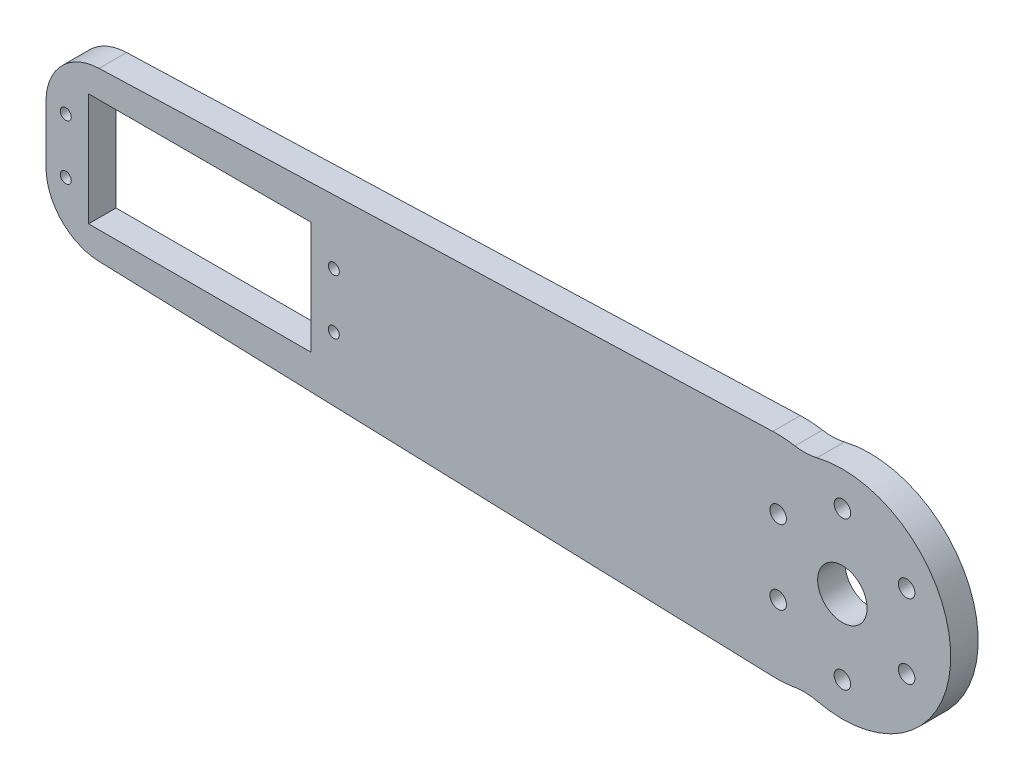
ISO-10303-21;
HEADER;
FILE_DESCRIPTION(('STEP AP214'),'2;1');
FILE_NAME('part.step','',(''),(''),'','','');
FILE_SCHEMA(('AUTOMOTIVE_DESIGN { 1 0 10303 214 1 1 1 1 }'));
ENDSEC;
DATA;
#1=APPLICATION_CONTEXT('core data for automotive mechanical design processes');
#2=APPLICATION_PROTOCOL_DEFINITION('international standard','automotive_design',2000,#1);
#3=PRODUCT_CONTEXT('',#1,'mechanical');
#4=PRODUCT('Part','Part','',(#3));
#5=PRODUCT_RELATED_PRODUCT_CATEGORY('part','',(#4));
#6=PRODUCT_DEFINITION_FORMATION('','',#4);
#7=PRODUCT_DEFINITION_CONTEXT('part definition',#1,'design');
#8=PRODUCT_DEFINITION('design','',#6,#7);
#9=PRODUCT_DEFINITION_SHAPE('','',#8);
#10=(LENGTH_UNIT() NAMED_UNIT(*) SI_UNIT(.MILLI.,.METRE.));
#11=(NAMED_UNIT(*) PLANE_ANGLE_UNIT() SI_UNIT($,.RADIAN.));
#12=(NAMED_UNIT(*) SI_UNIT($,.STERADIAN.) SOLID_ANGLE_UNIT());
#13=UNCERTAINTY_MEASURE_WITH_UNIT(LENGTH_MEASURE(1.E-05),#10,'distance_accuracy_value','');
#14=(GEOMETRIC_REPRESENTATION_CONTEXT(3) GLOBAL_UNCERTAINTY_ASSIGNED_CONTEXT((#13)) GLOBAL_UNIT_ASSIGNED_CONTEXT((#10,
#11,#12)) REPRESENTATION_CONTEXT('',''));
#15=CARTESIAN_POINT('',(0.,0.,0.));
#16=DIRECTION('',(0.,0.,1.));
#17=DIRECTION('',(1.,0.,0.));
#18=AXIS2_PLACEMENT_3D('',#15,#16,#17);
#19=CARTESIAN_POINT('',(0.,0.,5.));
#20=DIRECTION('',(0.,0.,1.));
#21=DIRECTION('',(1.,0.,0.));
#22=AXIS2_PLACEMENT_3D('',#19,#20,#21);
#23=PLANE('',#22);
#24=CARTESIAN_POINT('',(78.6913429510898,6.75000000000014,5.));
#25=DIRECTION('',(0.,0.,1.));
#26=DIRECTION('',(0.50000000000001,-0.866025403784433,0.));
#27=AXIS2_PLACEMENT_3D('',#24,#25,#26);
#28=CIRCLE('',#27,1.5);
#29=CARTESIAN_POINT('',(79.4413429510898,5.45096189432349,5.));
#30=VERTEX_POINT('',#29);
#31=EDGE_CURVE('E661',#30,#30,#28,.T.);
#32=ORIENTED_EDGE('',*,*,#31,.F.);
#33=EDGE_LOOP('',(#32));
#34=FACE_BOUND('',#33,.T.);
#35=CARTESIAN_POINT('',(78.6913429510899,-6.7499999999999,5.));
#36=DIRECTION('',(0.,0.,1.));
#37=DIRECTION('',(-0.499999999999992,-0.866025403784443,0.));
#38=AXIS2_PLACEMENT_3D('',#35,#36,#37);
#39=CIRCLE('',#38,1.5);
#40=CARTESIAN_POINT('',(77.94134295109,-8.04903810567656,5.));
#41=VERTEX_POINT('',#40);
#42=EDGE_CURVE('E663',#41,#41,#39,.T.);
#43=ORIENTED_EDGE('',*,*,#42,.F.);
#44=EDGE_LOOP('',(#43));
#45=FACE_BOUND('',#44,.T.);
#46=CARTESIAN_POINT('',(67.,-13.5,5.));
#47=DIRECTION('',(0.,0.,1.));
#48=DIRECTION('',(-1.,0.,0.));
#49=AXIS2_PLACEMENT_3D('',#46,#47,#48);
#50=CIRCLE('',#49,1.5);
#51=CARTESIAN_POINT('',(65.5,-13.5,5.));
#52=VERTEX_POINT('',#51);
#53=EDGE_CURVE('E666',#52,#52,#50,.T.);
#54=ORIENTED_EDGE('',*,*,#53,.F.);
#55=EDGE_LOOP('',(#54));
#56=FACE_BOUND('',#55,.T.);
#57=CARTESIAN_POINT('',(55.3086570489101,-6.75000000000005,5.));
#58=DIRECTION('',(0.,0.,1.));
#59=DIRECTION('',(-0.500000000000004,0.866025403784436,0.));
#60=AXIS2_PLACEMENT_3D('',#57,#58,#59);
#61=CIRCLE('',#60,1.5);
#62=CARTESIAN_POINT('',(54.5586570489101,-5.4509618943234,5.));
#63=VERTEX_POINT('',#62);
#64=EDGE_CURVE('E672',#63,#63,#61,.T.);
#65=ORIENTED_EDGE('',*,*,#64,.F.);
#66=EDGE_LOOP('',(#65));
#67=FACE_BOUND('',#66,.T.);
#68=CARTESIAN_POINT('',(55.30865704891,6.74999999999998,5.));
#69=DIRECTION('',(0.,0.,1.));
#70=DIRECTION('',(0.499999999999998,0.86602540378444,0.));
#71=AXIS2_PLACEMENT_3D('',#68,#69,#70);
#72=CIRCLE('',#71,1.5);
#73=CARTESIAN_POINT('',(56.05865704891,8.04903810567663,5.));
#74=VERTEX_POINT('',#73);
#75=EDGE_CURVE('E303',#74,#74,#72,.T.);
#76=ORIENTED_EDGE('',*,*,#75,.F.);
#77=EDGE_LOOP('',(#76));
#78=FACE_BOUND('',#77,.T.);
#79=CARTESIAN_POINT('',(67.,0.,5.));
#80=DIRECTION('',(0.,0.,1.));
#81=DIRECTION('',(1.,0.,0.));
#82=AXIS2_PLACEMENT_3D('',#79,#80,#81);
#83=CIRCLE('',#82,4.5);
#84=CARTESIAN_POINT('',(71.5,0.,5.));
#85=VERTEX_POINT('',#84);
#86=EDGE_CURVE('E297',#85,#85,#83,.T.);
#87=ORIENTED_EDGE('',*,*,#86,.F.);
#88=EDGE_LOOP('',(#87));
#89=FACE_BOUND('',#88,.T.);
#90=CARTESIAN_POINT('',(67.,13.5,5.));
#91=DIRECTION('',(0.,0.,1.));
#92=DIRECTION('',(1.,0.,0.));
#93=AXIS2_PLACEMENT_3D('',#90,#91,#92);
#94=CIRCLE('',#93,1.5);
#95=CARTESIAN_POINT('',(68.5,13.5,5.));
#96=VERTEX_POINT('',#95);
#97=EDGE_CURVE('E292',#96,#96,#94,.T.);
#98=ORIENTED_EDGE('',*,*,#97,.F.);
#99=EDGE_LOOP('',(#98));
#100=FACE_BOUND('',#99,.T.);
#101=CARTESIAN_POINT('',(-74.4,-5.00000000000002,5.));
#102=DIRECTION('',(0.,0.,1.));
#103=DIRECTION('',(1.,0.,0.));
#104=AXIS2_PLACEMENT_3D('',#101,#102,#103);
#105=CIRCLE('',#104,0.999999999999998);
#106=CARTESIAN_POINT('',(-73.4,-5.00000000000002,5.));
#107=VERTEX_POINT('',#106);
#108=EDGE_CURVE('E357',#107,#107,#105,.T.);
#109=ORIENTED_EDGE('',*,*,#108,.F.);
#110=EDGE_LOOP('',(#109));
#111=FACE_BOUND('',#110,.T.);
#112=CARTESIAN_POINT('',(-74.4,4.99999999999998,5.));
#113=DIRECTION('',(0.,0.,1.));
#114=DIRECTION('',(1.,0.,0.));
#115=AXIS2_PLACEMENT_3D('',#112,#113,#114);
#116=CIRCLE('',#115,0.999999999999998);
#117=CARTESIAN_POINT('',(-73.4,4.99999999999998,5.));
#118=VERTEX_POINT('',#117);
#119=EDGE_CURVE('E353',#118,#118,#116,.T.);
#120=ORIENTED_EDGE('',*,*,#119,.F.);
#121=EDGE_LOOP('',(#120));
#122=FACE_BOUND('',#121,.T.);
#123=CARTESIAN_POINT('',(-25.6,5.,5.));
#124=DIRECTION('',(0.,0.,1.));
#125=DIRECTION('',(1.,0.,0.));
#126=AXIS2_PLACEMENT_3D('',#123,#124,#125);
#127=CIRCLE('',#126,1.);
#128=CARTESIAN_POINT('',(-24.6,5.,5.));
#129=VERTEX_POINT('',#128);
#130=EDGE_CURVE('E349',#129,#129,#127,.T.);
#131=ORIENTED_EDGE('',*,*,#130,.F.);
#132=EDGE_LOOP('',(#131));
#133=FACE_BOUND('',#132,.T.);
#134=CARTESIAN_POINT('',(-25.6,-5.,5.));
#135=DIRECTION('',(0.,0.,1.));
#136=DIRECTION('',(1.,0.,0.));
#137=AXIS2_PLACEMENT_3D('',#134,#135,#136);
#138=CIRCLE('',#137,1.);
#139=CARTESIAN_POINT('',(-24.6,-5.,5.));
#140=VERTEX_POINT('',#139);
#141=EDGE_CURVE('E345',#140,#140,#138,.T.);
#142=ORIENTED_EDGE('',*,*,#141,.F.);
#143=EDGE_LOOP('',(#142));
#144=FACE_BOUND('',#143,.T.);
#145=DIRECTION('',(-0.999444906979154,-0.0333148302326385,0.));
#146=VECTOR('',#145,1.);
#147=CARTESIAN_POINT('',(75.,20.,5.));
#148=LINE('',#147,#146);
#149=CARTESIAN_POINT('',(54.3337033953472,19.3111234465116,5.));
#150=VERTEX_POINT('',#149);
#151=CARTESIAN_POINT('',(-68.3331483023264,15.2222283899225,5.));
#152=VERTEX_POINT('',#151);
#153=EDGE_CURVE('E205',#150,#152,#148,.T.);
#154=ORIENTED_EDGE('',*,*,#153,.T.);
#155=CARTESIAN_POINT('',(-68.,5.22777932013091,5.));
#156=DIRECTION('',(0.,0.,1.));
#157=DIRECTION('',(1.,0.,0.));
#158=AXIS2_PLACEMENT_3D('',#155,#156,#157);
#159=CIRCLE('',#158,10.);
#160=CARTESIAN_POINT('',(-78.,5.22777932013091,5.));
#161=VERTEX_POINT('',#160);
#162=EDGE_CURVE('E258',#152,#161,#159,.T.);
#163=ORIENTED_EDGE('',*,*,#162,.T.);
#164=DIRECTION('',(0.,-1.,0.));
#165=VECTOR('',#164,1.);
#166=CARTESIAN_POINT('',(-78.,15.,5.));
#167=LINE('',#166,#165);
#168=CARTESIAN_POINT('',(-78.,-5.22777932013091,5.));
#169=VERTEX_POINT('',#168);
#170=EDGE_CURVE('E198',#161,#169,#167,.T.);
#171=ORIENTED_EDGE('',*,*,#170,.T.);
#172=CARTESIAN_POINT('',(-68.,-5.22777932013091,5.));
#173=DIRECTION('',(0.,0.,1.));
#174=DIRECTION('',(1.,0.,0.));
#175=AXIS2_PLACEMENT_3D('',#172,#173,#174);
#176=CIRCLE('',#175,10.);
#177=CARTESIAN_POINT('',(-68.3331483023264,-15.2222283899225,5.));
#178=VERTEX_POINT('',#177);
#179=EDGE_CURVE('E58',#169,#178,#176,.T.);
#180=ORIENTED_EDGE('',*,*,#179,.T.);
#181=DIRECTION('',(0.999444906979154,-0.0333148302326385,0.));
#182=VECTOR('',#181,1.);
#183=CARTESIAN_POINT('',(75.,-20.,5.));
#184=LINE('',#183,#182);
#185=CARTESIAN_POINT('',(54.3337033953472,-19.3111234465116,5.));
#186=VERTEX_POINT('',#185);
#187=EDGE_CURVE('E201',#178,#186,#184,.T.);
#188=ORIENTED_EDGE('',*,*,#187,.T.);
#189=CARTESIAN_POINT('',(55.,0.677774693071516,5.));
#190=DIRECTION('',(0.,0.,1.));
#191=DIRECTION('',(1.,0.,0.));
#192=AXIS2_PLACEMENT_3D('',#189,#190,#191);
#193=CIRCLE('',#192,20.);
#194=CARTESIAN_POINT('',(58.3597488840395,-19.0380080059794,5.));
#195=VERTEX_POINT('',#194);
#196=EDGE_CURVE('E233',#186,#195,#193,.T.);
#197=ORIENTED_EDGE('',*,*,#196,.T.);
#198=CARTESIAN_POINT('',(60.0396233260593,-28.8958993555049,5.));
#199=DIRECTION('',(0.,0.,1.));
#200=DIRECTION('',(1.,0.,0.));
#201=AXIS2_PLACEMENT_3D('',#198,#199,#200);
#202=CIRCLE('',#201,10.);
#203=CARTESIAN_POINT('',(62.3814199088242,-19.1739659693439,5.));
#204=VERTEX_POINT('',#203);
#205=EDGE_CURVE('E282',#195,#204,#202,.F.);
#206=ORIENTED_EDGE('',*,*,#205,.T.);
#207=CARTESIAN_POINT('',(67.,0.,5.));
#208=DIRECTION('',(0.,0.,1.));
#209=DIRECTION('',(1.,0.,0.));
#210=AXIS2_PLACEMENT_3D('',#207,#208,#209);
#211=CIRCLE('',#210,19.722379497722);
#212=CARTESIAN_POINT('',(62.3814199088242,19.1739659693439,5.));
#213=VERTEX_POINT('',#212);
#214=EDGE_CURVE('E361',#204,#213,#211,.T.);
#215=ORIENTED_EDGE('',*,*,#214,.T.);
#216=CARTESIAN_POINT('',(60.0396233260593,28.8958993555049,5.));
#217=DIRECTION('',(0.,0.,1.));
#218=DIRECTION('',(1.,0.,0.));
#219=AXIS2_PLACEMENT_3D('',#216,#217,#218);
#220=CIRCLE('',#219,10.);
#221=CARTESIAN_POINT('',(58.3597488840395,19.0380080059794,5.));
#222=VERTEX_POINT('',#221);
#223=EDGE_CURVE('E50',#213,#222,#220,.F.);
#224=ORIENTED_EDGE('',*,*,#223,.T.);
#225=CARTESIAN_POINT('',(55.,-0.677774693071512,5.));
#226=DIRECTION('',(0.,0.,1.));
#227=DIRECTION('',(1.,0.,0.));
#228=AXIS2_PLACEMENT_3D('',#225,#226,#227);
#229=CIRCLE('',#228,20.);
#230=EDGE_CURVE('E230',#222,#150,#229,.T.);
#231=ORIENTED_EDGE('',*,*,#230,.T.);
#232=EDGE_LOOP('',(#154,#163,#171,#180,#188,#197,#206,#215,#224,#231));
#233=FACE_BOUND('',#232,.T.);
#234=DIRECTION('',(-1.,0.,0.));
#235=VECTOR('',#234,1.);
#236=CARTESIAN_POINT('',(-70.25,10.25,5.));
#237=LINE('',#236,#235);
#238=CARTESIAN_POINT('',(-29.75,10.25,5.));
#239=VERTEX_POINT('',#238);
#240=CARTESIAN_POINT('',(-70.25,10.25,5.));
#241=VERTEX_POINT('',#240);
#242=EDGE_CURVE('E154',#239,#241,#237,.T.);
#243=ORIENTED_EDGE('',*,*,#242,.F.);
#244=DIRECTION('',(0.,1.,0.));
#245=VECTOR('',#244,1.);
#246=CARTESIAN_POINT('',(-29.75,10.25,5.));
#247=LINE('',#246,#245);
#248=CARTESIAN_POINT('',(-29.75,-10.25,5.));
#249=VERTEX_POINT('',#248);
#250=EDGE_CURVE('E143',#249,#239,#247,.T.);
#251=ORIENTED_EDGE('',*,*,#250,.F.);
#252=DIRECTION('',(1.,0.,0.));
#253=VECTOR('',#252,1.);
#254=CARTESIAN_POINT('',(-70.25,-10.25,5.));
#255=LINE('',#254,#253);
#256=CARTESIAN_POINT('',(-70.25,-10.25,5.));
#257=VERTEX_POINT('',#256);
#258=EDGE_CURVE('E172',#257,#249,#255,.T.);
#259=ORIENTED_EDGE('',*,*,#258,.F.);
#260=DIRECTION('',(0.,-1.,0.));
#261=VECTOR('',#260,1.);
#262=CARTESIAN_POINT('',(-70.25,10.25,5.));
#263=LINE('',#262,#261);
#264=EDGE_CURVE('E168',#241,#257,#263,.T.);
#265=ORIENTED_EDGE('',*,*,#264,.F.);
#266=EDGE_LOOP('',(#243,#251,#259,#265));
#267=FACE_BOUND('',#266,.T.);
#268=ADVANCED_FACE('F40',(#34,#45,#56,#67,#78,#89,#100,#111,#122,#133,#144,#233,#267),#23,.T.);
#269=CARTESIAN_POINT('',(0.,0.,0.));
#270=DIRECTION('',(0.,0.,1.));
#271=DIRECTION('',(1.,0.,0.));
#272=AXIS2_PLACEMENT_3D('',#269,#270,#271);
#273=PLANE('',#272);
#274=CARTESIAN_POINT('',(78.6913429510898,6.75000000000014,0.));
#275=DIRECTION('',(0.,0.,1.));
#276=DIRECTION('',(1.,0.,0.));
#277=AXIS2_PLACEMENT_3D('',#274,#275,#276);
#278=CIRCLE('',#277,1.5);
#279=CARTESIAN_POINT('',(80.1913429510898,6.75000000000014,0.));
#280=VERTEX_POINT('',#279);
#281=EDGE_CURVE('E44',#280,#280,#278,.T.);
#282=ORIENTED_EDGE('',*,*,#281,.T.);
#283=EDGE_LOOP('',(#282));
#284=FACE_BOUND('',#283,.T.);
#285=CARTESIAN_POINT('',(78.6913429510899,-6.7499999999999,0.));
#286=DIRECTION('',(0.,0.,1.));
#287=DIRECTION('',(1.,0.,0.));
#288=AXIS2_PLACEMENT_3D('',#285,#286,#287);
#289=CIRCLE('',#288,1.5);
#290=CARTESIAN_POINT('',(80.1913429510899,-6.7499999999999,0.));
#291=VERTEX_POINT('',#290);
#292=EDGE_CURVE('E310',#291,#291,#289,.T.);
#293=ORIENTED_EDGE('',*,*,#292,.T.);
#294=EDGE_LOOP('',(#293));
#295=FACE_BOUND('',#294,.T.);
#296=CARTESIAN_POINT('',(67.,-13.5,0.));
#297=DIRECTION('',(0.,0.,1.));
#298=DIRECTION('',(1.,0.,0.));
#299=AXIS2_PLACEMENT_3D('',#296,#297,#298);
#300=CIRCLE('',#299,1.5);
#301=CARTESIAN_POINT('',(68.5,-13.5,0.));
#302=VERTEX_POINT('',#301);
#303=EDGE_CURVE('E307',#302,#302,#300,.T.);
#304=ORIENTED_EDGE('',*,*,#303,.T.);
#305=EDGE_LOOP('',(#304));
#306=FACE_BOUND('',#305,.T.);
#307=CARTESIAN_POINT('',(55.3086570489101,-6.75000000000005,0.));
#308=DIRECTION('',(0.,0.,1.));
#309=DIRECTION('',(1.,0.,0.));
#310=AXIS2_PLACEMENT_3D('',#307,#308,#309);
#311=CIRCLE('',#310,1.5);
#312=CARTESIAN_POINT('',(56.8086570489101,-6.75000000000005,0.));
#313=VERTEX_POINT('',#312);
#314=EDGE_CURVE('E302',#313,#313,#311,.T.);
#315=ORIENTED_EDGE('',*,*,#314,.T.);
#316=EDGE_LOOP('',(#315));
#317=FACE_BOUND('',#316,.T.);
#318=CARTESIAN_POINT('',(55.30865704891,6.74999999999998,0.));
#319=DIRECTION('',(0.,0.,1.));
#320=DIRECTION('',(1.,0.,0.));
#321=AXIS2_PLACEMENT_3D('',#318,#319,#320);
#322=CIRCLE('',#321,1.5);
#323=CARTESIAN_POINT('',(56.80865704891,6.74999999999998,0.));
#324=VERTEX_POINT('',#323);
#325=EDGE_CURVE('E298',#324,#324,#322,.T.);
#326=ORIENTED_EDGE('',*,*,#325,.T.);
#327=EDGE_LOOP('',(#326));
#328=FACE_BOUND('',#327,.T.);
#329=CARTESIAN_POINT('',(67.,0.,0.));
#330=DIRECTION('',(0.,0.,1.));
#331=DIRECTION('',(1.,0.,0.));
#332=AXIS2_PLACEMENT_3D('',#329,#330,#331);
#333=CIRCLE('',#332,4.5);
#334=CARTESIAN_POINT('',(71.5,0.,0.));
#335=VERTEX_POINT('',#334);
#336=EDGE_CURVE('E293',#335,#335,#333,.T.);
#337=ORIENTED_EDGE('',*,*,#336,.T.);
#338=EDGE_LOOP('',(#337));
#339=FACE_BOUND('',#338,.T.);
#340=CARTESIAN_POINT('',(67.,13.5,0.));
#341=DIRECTION('',(0.,0.,1.));
#342=DIRECTION('',(1.,0.,0.));
#343=AXIS2_PLACEMENT_3D('',#340,#341,#342);
#344=CIRCLE('',#343,1.5);
#345=CARTESIAN_POINT('',(68.5,13.5,0.));
#346=VERTEX_POINT('',#345);
#347=EDGE_CURVE('E287',#346,#346,#344,.T.);
#348=ORIENTED_EDGE('',*,*,#347,.T.);
#349=EDGE_LOOP('',(#348));
#350=FACE_BOUND('',#349,.T.);
#351=CARTESIAN_POINT('',(-74.4,-5.00000000000002,0.));
#352=DIRECTION('',(0.,0.,-1.));
#353=DIRECTION('',(1.,0.,0.));
#354=AXIS2_PLACEMENT_3D('',#351,#352,#353);
#355=CIRCLE('',#354,0.999999999999998);
#356=CARTESIAN_POINT('',(-73.4,-5.00000000000002,0.));
#357=VERTEX_POINT('',#356);
#358=EDGE_CURVE('E291',#357,#357,#355,.T.);
#359=ORIENTED_EDGE('',*,*,#358,.F.);
#360=EDGE_LOOP('',(#359));
#361=FACE_BOUND('',#360,.T.);
#362=CARTESIAN_POINT('',(-74.4,4.99999999999998,0.));
#363=DIRECTION('',(0.,0.,-1.));
#364=DIRECTION('',(-1.,0.,0.));
#365=AXIS2_PLACEMENT_3D('',#362,#363,#364);
#366=CIRCLE('',#365,0.999999999999998);
#367=CARTESIAN_POINT('',(-75.4,4.99999999999998,0.));
#368=VERTEX_POINT('',#367);
#369=EDGE_CURVE('E335',#368,#368,#366,.T.);
#370=ORIENTED_EDGE('',*,*,#369,.F.);
#371=EDGE_LOOP('',(#370));
#372=FACE_BOUND('',#371,.T.);
#373=CARTESIAN_POINT('',(-25.6,5.,0.));
#374=DIRECTION('',(0.,0.,-1.));
#375=DIRECTION('',(1.,0.,0.));
#376=AXIS2_PLACEMENT_3D('',#373,#374,#375);
#377=CIRCLE('',#376,1.);
#378=CARTESIAN_POINT('',(-24.6,5.,0.));
#379=VERTEX_POINT('',#378);
#380=EDGE_CURVE('E330',#379,#379,#377,.T.);
#381=ORIENTED_EDGE('',*,*,#380,.F.);
#382=EDGE_LOOP('',(#381));
#383=FACE_BOUND('',#382,.T.);
#384=CARTESIAN_POINT('',(-25.6,-5.,0.));
#385=DIRECTION('',(0.,0.,-1.));
#386=DIRECTION('',(-1.,0.,0.));
#387=AXIS2_PLACEMENT_3D('',#384,#385,#386);
#388=CIRCLE('',#387,1.);
#389=CARTESIAN_POINT('',(-26.6,-5.,0.));
#390=VERTEX_POINT('',#389);
#391=EDGE_CURVE('E334',#390,#390,#388,.T.);
#392=ORIENTED_EDGE('',*,*,#391,.F.);
#393=EDGE_LOOP('',(#392));
#394=FACE_BOUND('',#393,.T.);
#395=DIRECTION('',(0.,-1.,0.));
#396=VECTOR('',#395,1.);
#397=CARTESIAN_POINT('',(-78.,15.,0.));
#398=LINE('',#397,#396);
#399=CARTESIAN_POINT('',(-78.,5.22777932013091,0.));
#400=VERTEX_POINT('',#399);
#401=CARTESIAN_POINT('',(-78.,-5.22777932013091,0.));
#402=VERTEX_POINT('',#401);
#403=EDGE_CURVE('E163',#400,#402,#398,.T.);
#404=ORIENTED_EDGE('',*,*,#403,.F.);
#405=CARTESIAN_POINT('',(-68.,5.22777932013091,0.));
#406=DIRECTION('',(0.,0.,1.));
#407=DIRECTION('',(1.,0.,0.));
#408=AXIS2_PLACEMENT_3D('',#405,#406,#407);
#409=CIRCLE('',#408,10.);
#410=CARTESIAN_POINT('',(-68.3331483023264,15.2222283899225,0.));
#411=VERTEX_POINT('',#410);
#412=EDGE_CURVE('E250',#400,#411,#409,.F.);
#413=ORIENTED_EDGE('',*,*,#412,.T.);
#414=DIRECTION('',(-0.999444906979154,-0.0333148302326385,0.));
#415=VECTOR('',#414,1.);
#416=CARTESIAN_POINT('',(75.,20.,0.));
#417=LINE('',#416,#415);
#418=CARTESIAN_POINT('',(54.3337033953472,19.3111234465116,0.));
#419=VERTEX_POINT('',#418);
#420=EDGE_CURVE('E202',#419,#411,#417,.T.);
#421=ORIENTED_EDGE('',*,*,#420,.F.);
#422=CARTESIAN_POINT('',(55.,-0.677774693071512,0.));
#423=DIRECTION('',(0.,0.,1.));
#424=DIRECTION('',(1.,0.,0.));
#425=AXIS2_PLACEMENT_3D('',#422,#423,#424);
#426=CIRCLE('',#425,20.);
#427=CARTESIAN_POINT('',(58.3597488840395,19.0380080059794,0.));
#428=VERTEX_POINT('',#427);
#429=EDGE_CURVE('E209',#419,#428,#426,.F.);
#430=ORIENTED_EDGE('',*,*,#429,.T.);
#431=CARTESIAN_POINT('',(60.0396233260593,28.8958993555049,0.));
#432=DIRECTION('',(0.,0.,1.));
#433=DIRECTION('',(1.,0.,0.));
#434=AXIS2_PLACEMENT_3D('',#431,#432,#433);
#435=CIRCLE('',#434,10.);
#436=CARTESIAN_POINT('',(62.3814199088242,19.1739659693439,0.));
#437=VERTEX_POINT('',#436);
#438=EDGE_CURVE('E11',#428,#437,#435,.T.);
#439=ORIENTED_EDGE('',*,*,#438,.T.);
#440=CARTESIAN_POINT('',(67.,0.,0.));
#441=DIRECTION('',(0.,0.,1.));
#442=DIRECTION('',(1.,0.,0.));
#443=AXIS2_PLACEMENT_3D('',#440,#441,#442);
#444=CIRCLE('',#443,19.722379497722);
#445=CARTESIAN_POINT('',(62.3814199088242,-19.1739659693439,0.));
#446=VERTEX_POINT('',#445);
#447=EDGE_CURVE('E181',#437,#446,#444,.F.);
#448=ORIENTED_EDGE('',*,*,#447,.T.);
#449=CARTESIAN_POINT('',(60.0396233260593,-28.8958993555049,0.));
#450=DIRECTION('',(0.,0.,1.));
#451=DIRECTION('',(1.,0.,0.));
#452=AXIS2_PLACEMENT_3D('',#449,#450,#451);
#453=CIRCLE('',#452,10.);
#454=CARTESIAN_POINT('',(58.3597488840395,-19.0380080059794,0.));
#455=VERTEX_POINT('',#454);
#456=EDGE_CURVE('E279',#446,#455,#453,.T.);
#457=ORIENTED_EDGE('',*,*,#456,.T.);
#458=CARTESIAN_POINT('',(55.,0.677774693071516,0.));
#459=DIRECTION('',(0.,0.,1.));
#460=DIRECTION('',(1.,0.,0.));
#461=AXIS2_PLACEMENT_3D('',#458,#459,#460);
#462=CIRCLE('',#461,20.);
#463=CARTESIAN_POINT('',(54.3337033953472,-19.3111234465116,0.));
#464=VERTEX_POINT('',#463);
#465=EDGE_CURVE('E222',#455,#464,#462,.F.);
#466=ORIENTED_EDGE('',*,*,#465,.T.);
#467=DIRECTION('',(0.999444906979154,-0.0333148302326385,0.));
#468=VECTOR('',#467,1.);
#469=CARTESIAN_POINT('',(75.,-20.,0.));
#470=LINE('',#469,#468);
#471=CARTESIAN_POINT('',(-68.3331483023264,-15.2222283899225,0.));
#472=VERTEX_POINT('',#471);
#473=EDGE_CURVE('E213',#472,#464,#470,.T.);
#474=ORIENTED_EDGE('',*,*,#473,.F.);
#475=CARTESIAN_POINT('',(-68.,-5.22777932013091,0.));
#476=DIRECTION('',(0.,0.,1.));
#477=DIRECTION('',(1.,0.,0.));
#478=AXIS2_PLACEMENT_3D('',#475,#476,#477);
#479=CIRCLE('',#478,10.);
#480=EDGE_CURVE('E247',#472,#402,#479,.F.);
#481=ORIENTED_EDGE('',*,*,#480,.T.);
#482=EDGE_LOOP('',(#404,#413,#421,#430,#439,#448,#457,#466,#474,#481));
#483=FACE_BOUND('',#482,.T.);
#484=DIRECTION('',(0.,1.,0.));
#485=VECTOR('',#484,1.);
#486=CARTESIAN_POINT('',(-29.75,10.25,0.));
#487=LINE('',#486,#485);
#488=CARTESIAN_POINT('',(-29.75,-10.25,0.));
#489=VERTEX_POINT('',#488);
#490=CARTESIAN_POINT('',(-29.75,10.25,0.));
#491=VERTEX_POINT('',#490);
#492=EDGE_CURVE('E178',#489,#491,#487,.T.);
#493=ORIENTED_EDGE('',*,*,#492,.T.);
#494=DIRECTION('',(-1.,0.,0.));
#495=VECTOR('',#494,1.);
#496=CARTESIAN_POINT('',(-70.25,10.25,0.));
#497=LINE('',#496,#495);
#498=CARTESIAN_POINT('',(-70.25,10.25,0.));
#499=VERTEX_POINT('',#498);
#500=EDGE_CURVE('E161',#491,#499,#497,.T.);
#501=ORIENTED_EDGE('',*,*,#500,.T.);
#502=DIRECTION('',(0.,-1.,0.));
#503=VECTOR('',#502,1.);
#504=CARTESIAN_POINT('',(-70.25,10.25,0.));
#505=LINE('',#504,#503);
#506=CARTESIAN_POINT('',(-70.25,-10.25,0.));
#507=VERTEX_POINT('',#506);
#508=EDGE_CURVE('E184',#499,#507,#505,.T.);
#509=ORIENTED_EDGE('',*,*,#508,.T.);
#510=DIRECTION('',(1.,0.,0.));
#511=VECTOR('',#510,1.);
#512=CARTESIAN_POINT('',(-70.25,-10.25,0.));
#513=LINE('',#512,#511);
#514=EDGE_CURVE('E155',#507,#489,#513,.T.);
#515=ORIENTED_EDGE('',*,*,#514,.T.);
#516=EDGE_LOOP('',(#493,#501,#509,#515));
#517=FACE_BOUND('',#516,.T.);
#518=ADVANCED_FACE('F378',(#284,#295,#306,#317,#328,#339,#350,#361,#372,#383,#394,#483,#517),
#273,.F.);
#519=CARTESIAN_POINT('',(-78.,15.,5.));
#520=DIRECTION('',(1.,0.,0.));
#521=DIRECTION('',(0.,0.,-1.));
#522=AXIS2_PLACEMENT_3D('',#519,#520,#521);
#523=PLANE('',#522);
#524=ORIENTED_EDGE('',*,*,#170,.F.);
#525=DIRECTION('',(0.,0.,-1.));
#526=VECTOR('',#525,1.);
#527=CARTESIAN_POINT('',(-78.,5.22777932013091,5.));
#528=LINE('',#527,#526);
#529=EDGE_CURVE('E243',#161,#400,#528,.T.);
#530=ORIENTED_EDGE('',*,*,#529,.T.);
#531=ORIENTED_EDGE('',*,*,#403,.T.);
#532=DIRECTION('',(0.,0.,-1.));
#533=VECTOR('',#532,1.);
#534=CARTESIAN_POINT('',(-78.,-5.22777932013091,5.));
#535=LINE('',#534,#533);
#536=EDGE_CURVE('E240',#402,#169,#535,.F.);
#537=ORIENTED_EDGE('',*,*,#536,.T.);
#538=EDGE_LOOP('',(#524,#530,#531,#537));
#539=FACE_BOUND('',#538,.T.);
#540=ADVANCED_FACE('F392',(#539),#523,.F.);
#541=CARTESIAN_POINT('',(75.,-20.,5.));
#542=DIRECTION('',(0.0333148302326385,0.999444906979154,0.));
#543=DIRECTION('',(-0.999444906979154,0.0333148302326385,0.));
#544=AXIS2_PLACEMENT_3D('',#541,#542,#543);
#545=PLANE('',#544);
#546=ORIENTED_EDGE('',*,*,#187,.F.);
#547=DIRECTION('',(0.,0.,-1.));
#548=VECTOR('',#547,1.);
#549=CARTESIAN_POINT('',(-68.3331483023264,-15.2222283899225,5.));
#550=LINE('',#549,#548);
#551=EDGE_CURVE('E261',#178,#472,#550,.T.);
#552=ORIENTED_EDGE('',*,*,#551,.T.);
#553=ORIENTED_EDGE('',*,*,#473,.T.);
#554=DIRECTION('',(0.,0.,-1.));
#555=VECTOR('',#554,1.);
#556=CARTESIAN_POINT('',(54.3337033953472,-19.3111234465116,5.));
#557=LINE('',#556,#555);
#558=EDGE_CURVE('E226',#464,#186,#557,.F.);
#559=ORIENTED_EDGE('',*,*,#558,.T.);
#560=EDGE_LOOP('',(#546,#552,#553,#559));
#561=FACE_BOUND('',#560,.T.);
#562=ADVANCED_FACE('F386',(#561),#545,.F.);
#563=CARTESIAN_POINT('',(75.,20.,5.));
#564=DIRECTION('',(0.0333148302326385,-0.999444906979154,0.));
#565=DIRECTION('',(0.999444906979154,0.0333148302326385,0.));
#566=AXIS2_PLACEMENT_3D('',#563,#564,#565);
#567=PLANE('',#566);
#568=ORIENTED_EDGE('',*,*,#420,.T.);
#569=DIRECTION('',(0.,0.,-1.));
#570=VECTOR('',#569,1.);
#571=CARTESIAN_POINT('',(-68.3331483023264,15.2222283899224,5.));
#572=LINE('',#571,#570);
#573=EDGE_CURVE('E253',#411,#152,#572,.F.);
#574=ORIENTED_EDGE('',*,*,#573,.T.);
#575=ORIENTED_EDGE('',*,*,#153,.F.);
#576=DIRECTION('',(0.,0.,-1.));
#577=VECTOR('',#576,1.);
#578=CARTESIAN_POINT('',(54.3337033953472,19.3111234465116,5.));
#579=LINE('',#578,#577);
#580=EDGE_CURVE('E237',#150,#419,#579,.T.);
#581=ORIENTED_EDGE('',*,*,#580,.T.);
#582=EDGE_LOOP('',(#568,#574,#575,#581));
#583=FACE_BOUND('',#582,.T.);
#584=ADVANCED_FACE('F417',(#583),#567,.F.);
#585=CARTESIAN_POINT('',(-29.75,10.25,5.));
#586=DIRECTION('',(-1.,0.,0.));
#587=DIRECTION('',(0.,-1.,0.));
#588=AXIS2_PLACEMENT_3D('',#585,#586,#587);
#589=PLANE('',#588);
#590=ORIENTED_EDGE('',*,*,#492,.F.);
#591=DIRECTION('',(0.,0.,-1.));
#592=VECTOR('',#591,1.);
#593=CARTESIAN_POINT('',(-29.75,-10.25,5.));
#594=LINE('',#593,#592);
#595=EDGE_CURVE('E149',#249,#489,#594,.T.);
#596=ORIENTED_EDGE('',*,*,#595,.F.);
#597=ORIENTED_EDGE('',*,*,#250,.T.);
#598=DIRECTION('',(0.,0.,-1.));
#599=VECTOR('',#598,1.);
#600=CARTESIAN_POINT('',(-29.75,10.25,5.));
#601=LINE('',#600,#599);
#602=EDGE_CURVE('E146',#239,#491,#601,.T.);
#603=ORIENTED_EDGE('',*,*,#602,.T.);
#604=EDGE_LOOP('',(#590,#596,#597,#603));
#605=FACE_BOUND('',#604,.T.);
#606=ADVANCED_FACE('F145',(#605),#589,.T.);
#607=CARTESIAN_POINT('',(-70.25,10.25,5.));
#608=DIRECTION('',(0.,-1.,0.));
#609=DIRECTION('',(0.,0.,-1.));
#610=AXIS2_PLACEMENT_3D('',#607,#608,#609);
#611=PLANE('',#610);
#612=ORIENTED_EDGE('',*,*,#500,.F.);
#613=ORIENTED_EDGE('',*,*,#602,.F.);
#614=ORIENTED_EDGE('',*,*,#242,.T.);
#615=DIRECTION('',(0.,0.,-1.));
#616=VECTOR('',#615,1.);
#617=CARTESIAN_POINT('',(-70.25,10.25,5.));
#618=LINE('',#617,#616);
#619=EDGE_CURVE('E164',#241,#499,#618,.T.);
#620=ORIENTED_EDGE('',*,*,#619,.T.);
#621=EDGE_LOOP('',(#612,#613,#614,#620));
#622=FACE_BOUND('',#621,.T.);
#623=ADVANCED_FACE('F158',(#622),#611,.T.);
#624=CARTESIAN_POINT('',(-70.25,10.25,5.));
#625=DIRECTION('',(1.,0.,0.));
#626=DIRECTION('',(0.,0.,-1.));
#627=AXIS2_PLACEMENT_3D('',#624,#625,#626);
#628=PLANE('',#627);
#629=ORIENTED_EDGE('',*,*,#508,.F.);
#630=ORIENTED_EDGE('',*,*,#619,.F.);
#631=ORIENTED_EDGE('',*,*,#264,.T.);
#632=DIRECTION('',(0.,0.,-1.));
#633=VECTOR('',#632,1.);
#634=CARTESIAN_POINT('',(-70.25,-10.25,5.));
#635=LINE('',#634,#633);
#636=EDGE_CURVE('E193',#257,#507,#635,.T.);
#637=ORIENTED_EDGE('',*,*,#636,.T.);
#638=EDGE_LOOP('',(#629,#630,#631,#637));
#639=FACE_BOUND('',#638,.T.);
#640=ADVANCED_FACE('F434',(#639),#628,.T.);
#641=CARTESIAN_POINT('',(-70.25,-10.25,5.));
#642=DIRECTION('',(0.,1.,0.));
#643=DIRECTION('',(0.,0.,1.));
#644=AXIS2_PLACEMENT_3D('',#641,#642,#643);
#645=PLANE('',#644);
#646=ORIENTED_EDGE('',*,*,#514,.F.);
#647=ORIENTED_EDGE('',*,*,#636,.F.);
#648=ORIENTED_EDGE('',*,*,#258,.T.);
#649=ORIENTED_EDGE('',*,*,#595,.T.);
#650=EDGE_LOOP('',(#646,#647,#648,#649));
#651=FACE_BOUND('',#650,.T.);
#652=ADVANCED_FACE('F429',(#651),#645,.T.);
#653=CARTESIAN_POINT('',(55.,-0.677774693071512,5.));
#654=DIRECTION('',(0.,0.,-1.));
#655=DIRECTION('',(-1.,0.,0.));
#656=AXIS2_PLACEMENT_3D('',#653,#654,#655);
#657=CYLINDRICAL_SURFACE('',#656,20.);
#658=ORIENTED_EDGE('',*,*,#230,.F.);
#659=DIRECTION('',(0.,0.,-1.));
#660=VECTOR('',#659,1.);
#661=CARTESIAN_POINT('',(58.3597488840395,19.0380080059794,5.));
#662=LINE('',#661,#660);
#663=EDGE_CURVE('E276',#222,#428,#662,.T.);
#664=ORIENTED_EDGE('',*,*,#663,.T.);
#665=ORIENTED_EDGE('',*,*,#429,.F.);
#666=ORIENTED_EDGE('',*,*,#580,.F.);
#667=EDGE_LOOP('',(#658,#664,#665,#666));
#668=FACE_BOUND('',#667,.T.);
#669=ADVANCED_FACE('F427',(#668),#657,.T.);
#670=CARTESIAN_POINT('',(55.,0.677774693071516,5.));
#671=DIRECTION('',(0.,0.,-1.));
#672=DIRECTION('',(-1.,0.,0.));
#673=AXIS2_PLACEMENT_3D('',#670,#671,#672);
#674=CYLINDRICAL_SURFACE('',#673,20.);
#675=ORIENTED_EDGE('',*,*,#465,.F.);
#676=DIRECTION('',(0.,0.,-1.));
#677=VECTOR('',#676,1.);
#678=CARTESIAN_POINT('',(58.3597488840395,-19.0380080059794,5.));
#679=LINE('',#678,#677);
#680=EDGE_CURVE('E273',#455,#195,#679,.F.);
#681=ORIENTED_EDGE('',*,*,#680,.T.);
#682=ORIENTED_EDGE('',*,*,#196,.F.);
#683=ORIENTED_EDGE('',*,*,#558,.F.);
#684=EDGE_LOOP('',(#675,#681,#682,#683));
#685=FACE_BOUND('',#684,.T.);
#686=ADVANCED_FACE('F383',(#685),#674,.T.);
#687=CARTESIAN_POINT('',(67.,0.,-55.783313135895));
#688=DIRECTION('',(0.,0.,1.));
#689=DIRECTION('',(1.,0.,0.));
#690=AXIS2_PLACEMENT_3D('',#687,#688,#689);
#691=CYLINDRICAL_SURFACE('',#690,19.722379497722);
#692=ORIENTED_EDGE('',*,*,#214,.F.);
#693=DIRECTION('',(0.,0.,1.));
#694=VECTOR('',#693,1.);
#695=CARTESIAN_POINT('',(62.3814199088242,-19.1739659693439,-55.783313135895));
#696=LINE('',#695,#694);
#697=EDGE_CURVE('E269',#204,#446,#696,.F.);
#698=ORIENTED_EDGE('',*,*,#697,.T.);
#699=ORIENTED_EDGE('',*,*,#447,.F.);
#700=DIRECTION('',(0.,0.,1.));
#701=VECTOR('',#700,1.);
#702=CARTESIAN_POINT('',(62.3814199088242,19.1739659693439,-55.783313135895));
#703=LINE('',#702,#701);
#704=EDGE_CURVE('E265',#437,#213,#703,.T.);
#705=ORIENTED_EDGE('',*,*,#704,.T.);
#706=EDGE_LOOP('',(#692,#698,#699,#705));
#707=FACE_BOUND('',#706,.T.);
#708=ADVANCED_FACE('F369',(#707),#691,.T.);
#709=CARTESIAN_POINT('',(-68.,5.22777932013091,5.));
#710=DIRECTION('',(0.,0.,-1.));
#711=DIRECTION('',(-1.,0.,0.));
#712=AXIS2_PLACEMENT_3D('',#709,#710,#711);
#713=CYLINDRICAL_SURFACE('',#712,10.);
#714=ORIENTED_EDGE('',*,*,#162,.F.);
#715=ORIENTED_EDGE('',*,*,#573,.F.);
#716=ORIENTED_EDGE('',*,*,#412,.F.);
#717=ORIENTED_EDGE('',*,*,#529,.F.);
#718=EDGE_LOOP('',(#714,#715,#716,#717));
#719=FACE_BOUND('',#718,.T.);
#720=ADVANCED_FACE('F396',(#719),#713,.T.);
#721=CARTESIAN_POINT('',(-68.,-5.22777932013091,5.));
#722=DIRECTION('',(0.,0.,-1.));
#723=DIRECTION('',(-1.,0.,0.));
#724=AXIS2_PLACEMENT_3D('',#721,#722,#723);
#725=CYLINDRICAL_SURFACE('',#724,10.);
#726=ORIENTED_EDGE('',*,*,#179,.F.);
#727=ORIENTED_EDGE('',*,*,#536,.F.);
#728=ORIENTED_EDGE('',*,*,#480,.F.);
#729=ORIENTED_EDGE('',*,*,#551,.F.);
#730=EDGE_LOOP('',(#726,#727,#728,#729));
#731=FACE_BOUND('',#730,.T.);
#732=ADVANCED_FACE('F394',(#731),#725,.T.);
#733=CARTESIAN_POINT('',(60.0396233260593,-28.8958993555049,4.99999999999999));
#734=DIRECTION('',(0.,0.,1.));
#735=DIRECTION('',(1.,0.,0.));
#736=AXIS2_PLACEMENT_3D('',#733,#734,#735);
#737=CYLINDRICAL_SURFACE('',#736,10.);
#738=ORIENTED_EDGE('',*,*,#205,.F.);
#739=ORIENTED_EDGE('',*,*,#680,.F.);
#740=ORIENTED_EDGE('',*,*,#456,.F.);
#741=ORIENTED_EDGE('',*,*,#697,.F.);
#742=EDGE_LOOP('',(#738,#739,#740,#741));
#743=FACE_BOUND('',#742,.T.);
#744=ADVANCED_FACE('F373',(#743),#737,.F.);
#745=CARTESIAN_POINT('',(60.0396233260593,28.8958993555049,4.99999999999999));
#746=DIRECTION('',(0.,0.,-1.));
#747=DIRECTION('',(-1.,0.,0.));
#748=AXIS2_PLACEMENT_3D('',#745,#746,#747);
#749=CYLINDRICAL_SURFACE('',#748,10.);
#750=ORIENTED_EDGE('',*,*,#438,.F.);
#751=ORIENTED_EDGE('',*,*,#663,.F.);
#752=ORIENTED_EDGE('',*,*,#223,.F.);
#753=ORIENTED_EDGE('',*,*,#704,.F.);
#754=EDGE_LOOP('',(#750,#751,#752,#753));
#755=FACE_BOUND('',#754,.T.);
#756=ADVANCED_FACE('F42',(#755),#749,.F.);
#757=CARTESIAN_POINT('',(-25.6,-5.,6.));
#758=DIRECTION('',(0.,0.,-1.));
#759=DIRECTION('',(-1.,0.,0.));
#760=AXIS2_PLACEMENT_3D('',#757,#758,#759);
#761=CYLINDRICAL_SURFACE('',#760,1.);
#762=ORIENTED_EDGE('',*,*,#141,.T.);
#763=EDGE_LOOP('',(#762));
#764=FACE_BOUND('',#763,.T.);
#765=ORIENTED_EDGE('',*,*,#391,.T.);
#766=EDGE_LOOP('',(#765));
#767=FACE_BOUND('',#766,.T.);
#768=ADVANCED_FACE('F447',(#764,#767),#761,.F.);
#769=CARTESIAN_POINT('',(-25.6,5.,6.));
#770=DIRECTION('',(0.,0.,-1.));
#771=DIRECTION('',(-1.,0.,0.));
#772=AXIS2_PLACEMENT_3D('',#769,#770,#771);
#773=CYLINDRICAL_SURFACE('',#772,1.);
#774=ORIENTED_EDGE('',*,*,#130,.T.);
#775=EDGE_LOOP('',(#774));
#776=FACE_BOUND('',#775,.T.);
#777=ORIENTED_EDGE('',*,*,#380,.T.);
#778=EDGE_LOOP('',(#777));
#779=FACE_BOUND('',#778,.T.);
#780=ADVANCED_FACE('F451',(#776,#779),#773,.F.);
#781=CARTESIAN_POINT('',(-74.4,4.99999999999998,6.));
#782=DIRECTION('',(0.,0.,-1.));
#783=DIRECTION('',(-1.,0.,0.));
#784=AXIS2_PLACEMENT_3D('',#781,#782,#783);
#785=CYLINDRICAL_SURFACE('',#784,0.999999999999998);
#786=ORIENTED_EDGE('',*,*,#119,.T.);
#787=EDGE_LOOP('',(#786));
#788=FACE_BOUND('',#787,.T.);
#789=ORIENTED_EDGE('',*,*,#369,.T.);
#790=EDGE_LOOP('',(#789));
#791=FACE_BOUND('',#790,.T.);
#792=ADVANCED_FACE('F457',(#788,#791),#785,.F.);
#793=CARTESIAN_POINT('',(-74.4,-5.00000000000002,6.));
#794=DIRECTION('',(0.,0.,-1.));
#795=DIRECTION('',(-1.,0.,0.));
#796=AXIS2_PLACEMENT_3D('',#793,#794,#795);
#797=CYLINDRICAL_SURFACE('',#796,0.999999999999998);
#798=ORIENTED_EDGE('',*,*,#108,.T.);
#799=EDGE_LOOP('',(#798));
#800=FACE_BOUND('',#799,.T.);
#801=ORIENTED_EDGE('',*,*,#358,.T.);
#802=EDGE_LOOP('',(#801));
#803=FACE_BOUND('',#802,.T.);
#804=ADVANCED_FACE('F463',(#800,#803),#797,.F.);
#805=CARTESIAN_POINT('',(67.,13.5,-0.999999999999998));
#806=DIRECTION('',(0.,0.,1.));
#807=DIRECTION('',(1.,0.,0.));
#808=AXIS2_PLACEMENT_3D('',#805,#806,#807);
#809=CYLINDRICAL_SURFACE('',#808,1.5);
#810=ORIENTED_EDGE('',*,*,#97,.T.);
#811=EDGE_LOOP('',(#810));
#812=FACE_BOUND('',#811,.T.);
#813=ORIENTED_EDGE('',*,*,#347,.F.);
#814=EDGE_LOOP('',(#813));
#815=FACE_BOUND('',#814,.T.);
#816=ADVANCED_FACE('F589',(#812,#815),#809,.F.);
#817=CARTESIAN_POINT('',(67.,0.,-0.999999999999998));
#818=DIRECTION('',(0.,0.,1.));
#819=DIRECTION('',(1.,0.,0.));
#820=AXIS2_PLACEMENT_3D('',#817,#818,#819);
#821=CYLINDRICAL_SURFACE('',#820,4.5);
#822=ORIENTED_EDGE('',*,*,#86,.T.);
#823=EDGE_LOOP('',(#822));
#824=FACE_BOUND('',#823,.T.);
#825=ORIENTED_EDGE('',*,*,#336,.F.);
#826=EDGE_LOOP('',(#825));
#827=FACE_BOUND('',#826,.T.);
#828=ADVANCED_FACE('F597',(#824,#827),#821,.F.);
#829=CARTESIAN_POINT('',(55.30865704891,6.74999999999998,-0.999999999999998));
#830=DIRECTION('',(0.,0.,1.));
#831=DIRECTION('',(1.,0.,0.));
#832=AXIS2_PLACEMENT_3D('',#829,#830,#831);
#833=CYLINDRICAL_SURFACE('',#832,1.5);
#834=ORIENTED_EDGE('',*,*,#75,.T.);
#835=EDGE_LOOP('',(#834));
#836=FACE_BOUND('',#835,.T.);
#837=ORIENTED_EDGE('',*,*,#325,.F.);
#838=EDGE_LOOP('',(#837));
#839=FACE_BOUND('',#838,.T.);
#840=ADVANCED_FACE('F606',(#836,#839),#833,.F.);
#841=CARTESIAN_POINT('',(55.3086570489101,-6.75000000000005,-0.999999999999998));
#842=DIRECTION('',(0.,0.,1.));
#843=DIRECTION('',(1.,0.,0.));
#844=AXIS2_PLACEMENT_3D('',#841,#842,#843);
#845=CYLINDRICAL_SURFACE('',#844,1.5);
#846=ORIENTED_EDGE('',*,*,#64,.T.);
#847=EDGE_LOOP('',(#846));
#848=FACE_BOUND('',#847,.T.);
#849=ORIENTED_EDGE('',*,*,#314,.F.);
#850=EDGE_LOOP('',(#849));
#851=FACE_BOUND('',#850,.T.);
#852=ADVANCED_FACE('F615',(#848,#851),#845,.F.);
#853=CARTESIAN_POINT('',(67.,-13.5,-0.999999999999998));
#854=DIRECTION('',(0.,0.,1.));
#855=DIRECTION('',(1.,0.,0.));
#856=AXIS2_PLACEMENT_3D('',#853,#854,#855);
#857=CYLINDRICAL_SURFACE('',#856,1.5);
#858=ORIENTED_EDGE('',*,*,#53,.T.);
#859=EDGE_LOOP('',(#858));
#860=FACE_BOUND('',#859,.T.);
#861=ORIENTED_EDGE('',*,*,#303,.F.);
#862=EDGE_LOOP('',(#861));
#863=FACE_BOUND('',#862,.T.);
#864=ADVANCED_FACE('F622',(#860,#863),#857,.F.);
#865=CARTESIAN_POINT('',(78.6913429510899,-6.7499999999999,-0.999999999999998));
#866=DIRECTION('',(0.,0.,1.));
#867=DIRECTION('',(1.,0.,0.));
#868=AXIS2_PLACEMENT_3D('',#865,#866,#867);
#869=CYLINDRICAL_SURFACE('',#868,1.5);
#870=ORIENTED_EDGE('',*,*,#42,.T.);
#871=EDGE_LOOP('',(#870));
#872=FACE_BOUND('',#871,.T.);
#873=ORIENTED_EDGE('',*,*,#292,.F.);
#874=EDGE_LOOP('',(#873));
#875=FACE_BOUND('',#874,.T.);
#876=ADVANCED_FACE('F630',(#872,#875),#869,.F.);
#877=CARTESIAN_POINT('',(78.6913429510898,6.75000000000014,-0.999999999999998));
#878=DIRECTION('',(0.,0.,1.));
#879=DIRECTION('',(1.,0.,0.));
#880=AXIS2_PLACEMENT_3D('',#877,#878,#879);
#881=CYLINDRICAL_SURFACE('',#880,1.5);
#882=ORIENTED_EDGE('',*,*,#31,.T.);
#883=EDGE_LOOP('',(#882));
#884=FACE_BOUND('',#883,.T.);
#885=ORIENTED_EDGE('',*,*,#281,.F.);
#886=EDGE_LOOP('',(#885));
#887=FACE_BOUND('',#886,.T.);
#888=ADVANCED_FACE('F638',(#884,#887),#881,.F.);
#889=CLOSED_SHELL('',(#268,#518,#540,#562,#584,#606,#623,#640,#652,#669,#686,#708,#720,#732,
#744,#756,#768,#780,#792,#804,#816,#828,#840,#852,#864,#876,#888));
#890=MANIFOLD_SOLID_BREP('B2',#889);
#891=ADVANCED_BREP_SHAPE_REPRESENTATION('',(#18,#890),#14);
#892=SHAPE_DEFINITION_REPRESENTATION(#9,#891);
ENDSEC;
END-ISO-10303-21;
